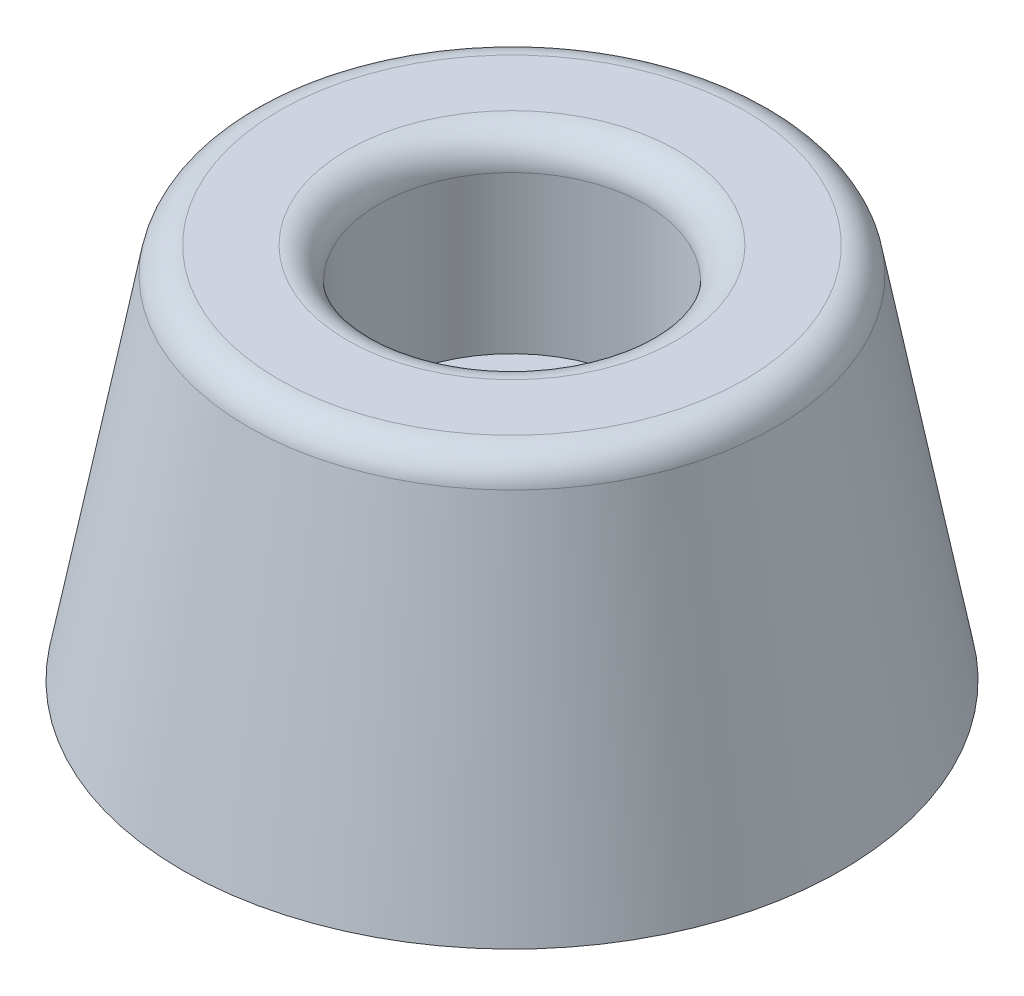
ISO-10303-21;
HEADER;
FILE_DESCRIPTION(('STEP AP214'),'2;1');
FILE_NAME('part.step','',(''),(''),'','','');
FILE_SCHEMA(('AUTOMOTIVE_DESIGN { 1 0 10303 214 1 1 1 1 }'));
ENDSEC;
DATA;
#1=APPLICATION_CONTEXT('core data for automotive mechanical design processes');
#2=APPLICATION_PROTOCOL_DEFINITION('international standard','automotive_design',2000,#1);
#3=PRODUCT_CONTEXT('',#1,'mechanical');
#4=PRODUCT('Part','Part','',(#3));
#5=PRODUCT_RELATED_PRODUCT_CATEGORY('part','',(#4));
#6=PRODUCT_DEFINITION_FORMATION('','',#4);
#7=PRODUCT_DEFINITION_CONTEXT('part definition',#1,'design');
#8=PRODUCT_DEFINITION('design','',#6,#7);
#9=PRODUCT_DEFINITION_SHAPE('','',#8);
#10=(LENGTH_UNIT() NAMED_UNIT(*) SI_UNIT(.MILLI.,.METRE.));
#11=(NAMED_UNIT(*) PLANE_ANGLE_UNIT() SI_UNIT($,.RADIAN.));
#12=(NAMED_UNIT(*) SI_UNIT($,.STERADIAN.) SOLID_ANGLE_UNIT());
#13=UNCERTAINTY_MEASURE_WITH_UNIT(LENGTH_MEASURE(1.E-05),#10,'distance_accuracy_value','');
#14=(GEOMETRIC_REPRESENTATION_CONTEXT(3) GLOBAL_UNCERTAINTY_ASSIGNED_CONTEXT((#13)) GLOBAL_UNIT_ASSIGNED_CONTEXT((#10,
#11,#12)) REPRESENTATION_CONTEXT('',''));
#15=CARTESIAN_POINT('',(0.,0.,0.));
#16=DIRECTION('',(0.,0.,1.));
#17=DIRECTION('',(1.,0.,0.));
#18=AXIS2_PLACEMENT_3D('',#15,#16,#17);
#19=CARTESIAN_POINT('',(0.,0.,0.));
#20=DIRECTION('',(0.,-1.,0.));
#21=DIRECTION('',(0.,0.,-1.));
#22=AXIS2_PLACEMENT_3D('',#19,#20,#21);
#23=CYLINDRICAL_SURFACE('',#22,2.1);
#24=CARTESIAN_POINT('',(0.,0.,0.));
#25=DIRECTION('',(0.,-1.,0.));
#26=DIRECTION('',(0.,0.,-1.));
#27=AXIS2_PLACEMENT_3D('',#24,#25,#26);
#28=CIRCLE('',#27,2.1);
#29=CARTESIAN_POINT('',(0.,0.,-2.1));
#30=VERTEX_POINT('',#29);
#31=EDGE_CURVE('E63',#30,#30,#28,.T.);
#32=ORIENTED_EDGE('',*,*,#31,.T.);
#33=EDGE_LOOP('',(#32));
#34=FACE_BOUND('',#33,.T.);
#35=CARTESIAN_POINT('',(0.,6.,0.));
#36=DIRECTION('',(0.,-1.,0.));
#37=DIRECTION('',(0.,0.,-1.));
#38=AXIS2_PLACEMENT_3D('',#35,#36,#37);
#39=CIRCLE('',#38,2.1);
#40=CARTESIAN_POINT('',(0.,6.,-2.1));
#41=VERTEX_POINT('',#40);
#42=EDGE_CURVE('E54',#41,#41,#39,.T.);
#43=ORIENTED_EDGE('',*,*,#42,.F.);
#44=EDGE_LOOP('',(#43));
#45=FACE_BOUND('',#44,.T.);
#46=ADVANCED_FACE('F34',(#34,#45),#23,.F.);
#47=CARTESIAN_POINT('',(0.,6.,-2.1));
#48=DIRECTION('',(0.,1.,0.));
#49=DIRECTION('',(0.,0.,1.));
#50=AXIS2_PLACEMENT_3D('',#47,#48,#49);
#51=PLANE('',#50);
#52=ORIENTED_EDGE('',*,*,#42,.T.);
#53=EDGE_LOOP('',(#52));
#54=FACE_BOUND('',#53,.T.);
#55=CARTESIAN_POINT('',(0.,6.,0.));
#56=DIRECTION('',(0.,-1.,0.));
#57=DIRECTION('',(0.,0.,-1.));
#58=AXIS2_PLACEMENT_3D('',#55,#56,#57);
#59=CIRCLE('',#58,4.25);
#60=CARTESIAN_POINT('',(0.,6.,-4.25));
#61=VERTEX_POINT('',#60);
#62=EDGE_CURVE('E57',#61,#61,#59,.T.);
#63=ORIENTED_EDGE('',*,*,#62,.F.);
#64=EDGE_LOOP('',(#63));
#65=FACE_BOUND('',#64,.T.);
#66=ADVANCED_FACE('F84',(#54,#65),#51,.T.);
#67=CARTESIAN_POINT('',(0.,0.,0.));
#68=DIRECTION('',(0.,-1.,0.));
#69=DIRECTION('',(0.,0.,-1.));
#70=AXIS2_PLACEMENT_3D('',#67,#68,#69);
#71=CYLINDRICAL_SURFACE('',#70,4.25);
#72=CARTESIAN_POINT('',(0.,11.,0.));
#73=DIRECTION('',(0.,1.,0.));
#74=DIRECTION('',(0.,0.,1.));
#75=AXIS2_PLACEMENT_3D('',#72,#73,#74);
#76=CIRCLE('',#75,4.25);
#77=CARTESIAN_POINT('',(0.,11.,4.25));
#78=VERTEX_POINT('',#77);
#79=EDGE_CURVE('E10',#78,#78,#76,.T.);
#80=ORIENTED_EDGE('',*,*,#79,.T.);
#81=EDGE_LOOP('',(#80));
#82=FACE_BOUND('',#81,.T.);
#83=ORIENTED_EDGE('',*,*,#62,.T.);
#84=EDGE_LOOP('',(#83));
#85=FACE_BOUND('',#84,.T.);
#86=ADVANCED_FACE('F89',(#82,#85),#71,.F.);
#87=CARTESIAN_POINT('',(0.,12.,-4.25));
#88=DIRECTION('',(0.,1.,0.));
#89=DIRECTION('',(0.,0.,1.));
#90=AXIS2_PLACEMENT_3D('',#87,#88,#89);
#91=PLANE('',#90);
#92=CARTESIAN_POINT('',(0.,12.,0.));
#93=DIRECTION('',(0.,1.,0.));
#94=DIRECTION('',(0.,0.,1.));
#95=AXIS2_PLACEMENT_3D('',#92,#93,#94);
#96=CIRCLE('',#95,7.42007371274377);
#97=CARTESIAN_POINT('',(0.,12.,7.42007371274377));
#98=VERTEX_POINT('',#97);
#99=EDGE_CURVE('E41',#98,#98,#96,.T.);
#100=ORIENTED_EDGE('',*,*,#99,.T.);
#101=EDGE_LOOP('',(#100));
#102=FACE_BOUND('',#101,.T.);
#103=CARTESIAN_POINT('',(0.,12.,0.));
#104=DIRECTION('',(0.,1.,0.));
#105=DIRECTION('',(0.,0.,1.));
#106=AXIS2_PLACEMENT_3D('',#103,#104,#105);
#107=CIRCLE('',#106,5.25);
#108=CARTESIAN_POINT('',(0.,12.,5.25));
#109=VERTEX_POINT('',#108);
#110=EDGE_CURVE('E45',#109,#109,#107,.F.);
#111=ORIENTED_EDGE('',*,*,#110,.T.);
#112=EDGE_LOOP('',(#111));
#113=FACE_BOUND('',#112,.T.);
#114=ADVANCED_FACE('F80',(#102,#113),#91,.T.);
#115=CARTESIAN_POINT('',(0.,0.,0.));
#116=DIRECTION('',(0.,-1.,0.));
#117=DIRECTION('',(0.,0.,-1.));
#118=AXIS2_PLACEMENT_3D('',#115,#116,#117);
#119=CONICAL_SURFACE('',#118,10.5,0.185347949995695);
#120=CARTESIAN_POINT('',(0.,11.1842885350502,0.));
#121=DIRECTION('',(0.,1.,0.));
#122=DIRECTION('',(0.,0.,1.));
#123=AXIS2_PLACEMENT_3D('',#120,#121,#122);
#124=CIRCLE('',#123,8.40294589967809);
#125=CARTESIAN_POINT('',(0.,11.1842885350502,8.40294589967809));
#126=VERTEX_POINT('',#125);
#127=EDGE_CURVE('E49',#126,#126,#124,.F.);
#128=ORIENTED_EDGE('',*,*,#127,.T.);
#129=EDGE_LOOP('',(#128));
#130=FACE_BOUND('',#129,.T.);
#131=CARTESIAN_POINT('',(0.,0.,0.));
#132=DIRECTION('',(0.,-1.,0.));
#133=DIRECTION('',(0.,0.,-1.));
#134=AXIS2_PLACEMENT_3D('',#131,#132,#133);
#135=CIRCLE('',#134,10.5);
#136=CARTESIAN_POINT('',(0.,0.,-10.5));
#137=VERTEX_POINT('',#136);
#138=EDGE_CURVE('E60',#137,#137,#135,.T.);
#139=ORIENTED_EDGE('',*,*,#138,.F.);
#140=EDGE_LOOP('',(#139));
#141=FACE_BOUND('',#140,.T.);
#142=ADVANCED_FACE('F72',(#130,#141),#119,.T.);
#143=CARTESIAN_POINT('',(0.,0.,-10.5));
#144=DIRECTION('',(0.,-1.,0.));
#145=DIRECTION('',(0.,0.,-1.));
#146=AXIS2_PLACEMENT_3D('',#143,#144,#145);
#147=PLANE('',#146);
#148=ORIENTED_EDGE('',*,*,#138,.T.);
#149=EDGE_LOOP('',(#148));
#150=FACE_BOUND('',#149,.T.);
#151=ORIENTED_EDGE('',*,*,#31,.F.);
#152=EDGE_LOOP('',(#151));
#153=FACE_BOUND('',#152,.T.);
#154=ADVANCED_FACE('F69',(#150,#153),#147,.T.);
#155=CARTESIAN_POINT('',(0.,11.,0.));
#156=DIRECTION('',(0.,1.,0.));
#157=DIRECTION('',(0.,0.,1.));
#158=AXIS2_PLACEMENT_3D('',#155,#156,#157);
#159=TOROIDAL_SURFACE('',#158,7.42007371274377,1.);
#160=ORIENTED_EDGE('',*,*,#99,.F.);
#161=EDGE_LOOP('',(#160));
#162=FACE_BOUND('',#161,.T.);
#163=ORIENTED_EDGE('',*,*,#127,.F.);
#164=EDGE_LOOP('',(#163));
#165=FACE_BOUND('',#164,.T.);
#166=ADVANCED_FACE('F71',(#162,#165),#159,.T.);
#167=CARTESIAN_POINT('',(0.,11.,0.));
#168=DIRECTION('',(0.,1.,0.));
#169=DIRECTION('',(0.,0.,1.));
#170=AXIS2_PLACEMENT_3D('',#167,#168,#169);
#171=TOROIDAL_SURFACE('',#170,5.25,1.);
#172=ORIENTED_EDGE('',*,*,#79,.F.);
#173=EDGE_LOOP('',(#172));
#174=FACE_BOUND('',#173,.T.);
#175=ORIENTED_EDGE('',*,*,#110,.F.);
#176=EDGE_LOOP('',(#175));
#177=FACE_BOUND('',#176,.T.);
#178=ADVANCED_FACE('F36',(#174,#177),#171,.T.);
#179=CLOSED_SHELL('',(#46,#66,#86,#114,#142,#154,#166,#178));
#180=MANIFOLD_SOLID_BREP('B2',#179);
#181=ADVANCED_BREP_SHAPE_REPRESENTATION('',(#18,#180),#14);
#182=SHAPE_DEFINITION_REPRESENTATION(#9,#181);
ENDSEC;
END-ISO-10303-21;
